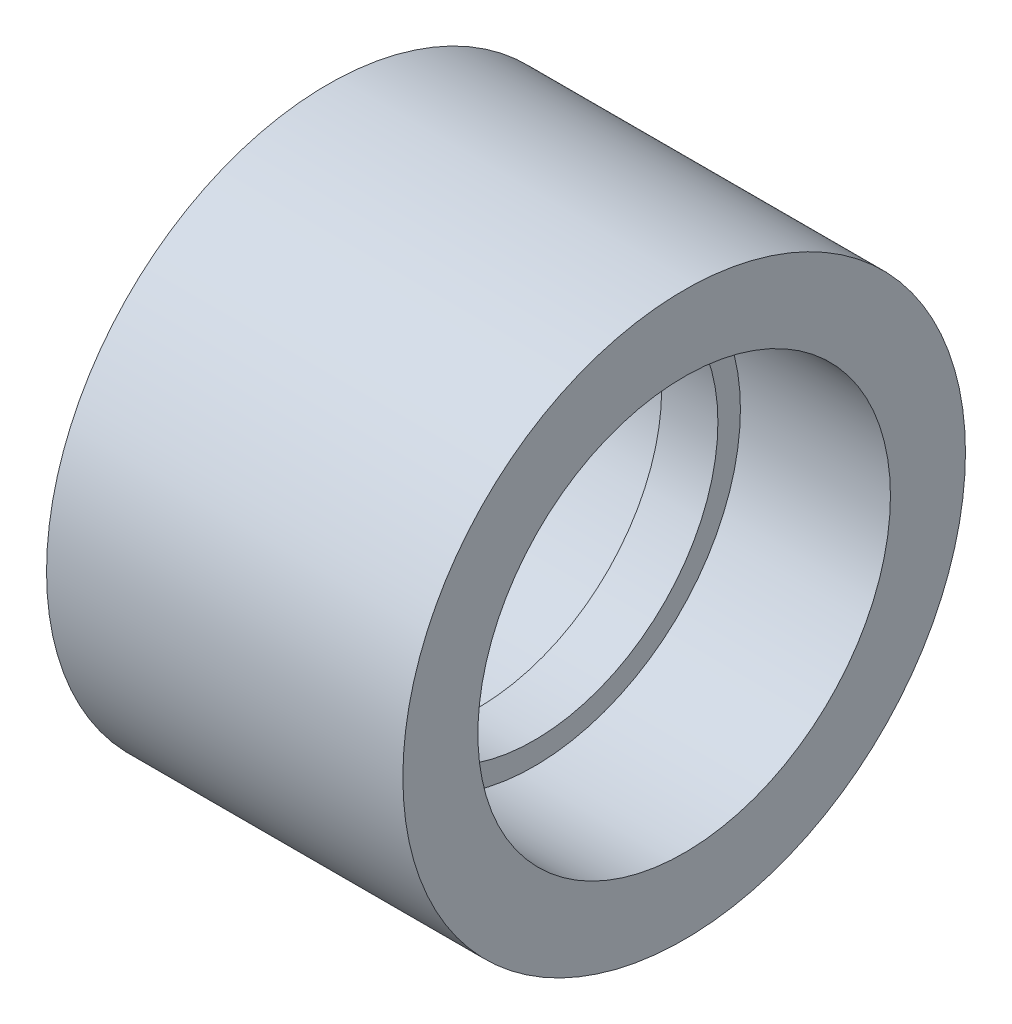
ISO-10303-21;
HEADER;
FILE_DESCRIPTION(('STEP AP214'),'2;1');
FILE_NAME('part.step','',(''),(''),'','','');
FILE_SCHEMA(('AUTOMOTIVE_DESIGN { 1 0 10303 214 1 1 1 1 }'));
ENDSEC;
DATA;
#1=APPLICATION_CONTEXT('core data for automotive mechanical design processes');
#2=APPLICATION_PROTOCOL_DEFINITION('international standard','automotive_design',2000,#1);
#3=PRODUCT_CONTEXT('',#1,'mechanical');
#4=PRODUCT('Part','Part','',(#3));
#5=PRODUCT_RELATED_PRODUCT_CATEGORY('part','',(#4));
#6=PRODUCT_DEFINITION_FORMATION('','',#4);
#7=PRODUCT_DEFINITION_CONTEXT('part definition',#1,'design');
#8=PRODUCT_DEFINITION('design','',#6,#7);
#9=PRODUCT_DEFINITION_SHAPE('','',#8);
#10=(LENGTH_UNIT() NAMED_UNIT(*) SI_UNIT(.MILLI.,.METRE.));
#11=(NAMED_UNIT(*) PLANE_ANGLE_UNIT() SI_UNIT($,.RADIAN.));
#12=(NAMED_UNIT(*) SI_UNIT($,.STERADIAN.) SOLID_ANGLE_UNIT());
#13=UNCERTAINTY_MEASURE_WITH_UNIT(LENGTH_MEASURE(1.E-05),#10,'distance_accuracy_value','');
#14=(GEOMETRIC_REPRESENTATION_CONTEXT(3) GLOBAL_UNCERTAINTY_ASSIGNED_CONTEXT((#13)) GLOBAL_UNIT_ASSIGNED_CONTEXT((#10,
#11,#12)) REPRESENTATION_CONTEXT('',''));
#15=CARTESIAN_POINT('',(0.,0.,0.));
#16=DIRECTION('',(0.,0.,1.));
#17=DIRECTION('',(1.,0.,0.));
#18=AXIS2_PLACEMENT_3D('',#15,#16,#17);
#19=CARTESIAN_POINT('',(-9.5,0.,-15.));
#20=DIRECTION('',(-1.,0.,0.));
#21=DIRECTION('',(0.,0.,1.));
#22=AXIS2_PLACEMENT_3D('',#19,#20,#21);
#23=PLANE('',#22);
#24=CARTESIAN_POINT('',(-9.49999999999999,0.,0.));
#25=DIRECTION('',(1.,0.,0.));
#26=DIRECTION('',(0.,0.,-1.));
#27=AXIS2_PLACEMENT_3D('',#24,#25,#26);
#28=CIRCLE('',#27,11.);
#29=CARTESIAN_POINT('',(-9.49999999999999,0.,-11.));
#30=VERTEX_POINT('',#29);
#31=EDGE_CURVE('E10',#30,#30,#28,.T.);
#32=ORIENTED_EDGE('',*,*,#31,.T.);
#33=EDGE_LOOP('',(#32));
#34=FACE_BOUND('',#33,.T.);
#35=CARTESIAN_POINT('',(-9.49999999999999,0.,0.));
#36=DIRECTION('',(1.,0.,0.));
#37=DIRECTION('',(0.,0.,-1.));
#38=AXIS2_PLACEMENT_3D('',#35,#36,#37);
#39=CIRCLE('',#38,15.);
#40=CARTESIAN_POINT('',(-9.49999999999999,0.,-15.));
#41=VERTEX_POINT('',#40);
#42=EDGE_CURVE('E59',#41,#41,#39,.T.);
#43=ORIENTED_EDGE('',*,*,#42,.F.);
#44=EDGE_LOOP('',(#43));
#45=FACE_BOUND('',#44,.T.);
#46=ADVANCED_FACE('F31',(#34,#45),#23,.T.);
#47=CARTESIAN_POINT('',(88.99,0.,0.));
#48=DIRECTION('',(1.,0.,0.));
#49=DIRECTION('',(0.,0.,-1.));
#50=AXIS2_PLACEMENT_3D('',#47,#48,#49);
#51=CYLINDRICAL_SURFACE('',#50,11.);
#52=CARTESIAN_POINT('',(-1.5,0.,0.));
#53=DIRECTION('',(1.,0.,0.));
#54=DIRECTION('',(0.,0.,-1.));
#55=AXIS2_PLACEMENT_3D('',#52,#53,#54);
#56=CIRCLE('',#55,11.);
#57=CARTESIAN_POINT('',(-1.5,0.,-11.));
#58=VERTEX_POINT('',#57);
#59=EDGE_CURVE('E37',#58,#58,#56,.T.);
#60=ORIENTED_EDGE('',*,*,#59,.T.);
#61=EDGE_LOOP('',(#60));
#62=FACE_BOUND('',#61,.T.);
#63=ORIENTED_EDGE('',*,*,#31,.F.);
#64=EDGE_LOOP('',(#63));
#65=FACE_BOUND('',#64,.T.);
#66=ADVANCED_FACE('F67',(#62,#65),#51,.F.);
#67=CARTESIAN_POINT('',(-1.5,0.,-11.));
#68=DIRECTION('',(-1.,0.,0.));
#69=DIRECTION('',(0.,0.,1.));
#70=AXIS2_PLACEMENT_3D('',#67,#68,#69);
#71=PLANE('',#70);
#72=CARTESIAN_POINT('',(-1.5,0.,0.));
#73=DIRECTION('',(1.,0.,0.));
#74=DIRECTION('',(0.,0.,-1.));
#75=AXIS2_PLACEMENT_3D('',#72,#73,#74);
#76=CIRCLE('',#75,9.8);
#77=CARTESIAN_POINT('',(-1.5,0.,-9.8));
#78=VERTEX_POINT('',#77);
#79=EDGE_CURVE('E41',#78,#78,#76,.T.);
#80=ORIENTED_EDGE('',*,*,#79,.T.);
#81=EDGE_LOOP('',(#80));
#82=FACE_BOUND('',#81,.T.);
#83=ORIENTED_EDGE('',*,*,#59,.F.);
#84=EDGE_LOOP('',(#83));
#85=FACE_BOUND('',#84,.T.);
#86=ADVANCED_FACE('F71',(#82,#85),#71,.T.);
#87=CARTESIAN_POINT('',(88.99,0.,0.));
#88=DIRECTION('',(1.,0.,0.));
#89=DIRECTION('',(0.,0.,-1.));
#90=AXIS2_PLACEMENT_3D('',#87,#88,#89);
#91=CYLINDRICAL_SURFACE('',#90,9.8);
#92=CARTESIAN_POINT('',(1.5,0.,0.));
#93=DIRECTION('',(1.,0.,0.));
#94=DIRECTION('',(0.,0.,-1.));
#95=AXIS2_PLACEMENT_3D('',#92,#93,#94);
#96=CIRCLE('',#95,9.8);
#97=CARTESIAN_POINT('',(1.5,0.,-9.8));
#98=VERTEX_POINT('',#97);
#99=EDGE_CURVE('E45',#98,#98,#96,.T.);
#100=ORIENTED_EDGE('',*,*,#99,.T.);
#101=EDGE_LOOP('',(#100));
#102=FACE_BOUND('',#101,.T.);
#103=ORIENTED_EDGE('',*,*,#79,.F.);
#104=EDGE_LOOP('',(#103));
#105=FACE_BOUND('',#104,.T.);
#106=ADVANCED_FACE('F75',(#102,#105),#91,.F.);
#107=CARTESIAN_POINT('',(1.5,0.,-11.));
#108=DIRECTION('',(1.,0.,0.));
#109=DIRECTION('',(0.,0.,-1.));
#110=AXIS2_PLACEMENT_3D('',#107,#108,#109);
#111=PLANE('',#110);
#112=CARTESIAN_POINT('',(1.5,0.,0.));
#113=DIRECTION('',(1.,0.,0.));
#114=DIRECTION('',(0.,0.,-1.));
#115=AXIS2_PLACEMENT_3D('',#112,#113,#114);
#116=CIRCLE('',#115,11.);
#117=CARTESIAN_POINT('',(1.5,0.,-11.));
#118=VERTEX_POINT('',#117);
#119=EDGE_CURVE('E50',#118,#118,#116,.T.);
#120=ORIENTED_EDGE('',*,*,#119,.T.);
#121=EDGE_LOOP('',(#120));
#122=FACE_BOUND('',#121,.T.);
#123=ORIENTED_EDGE('',*,*,#99,.F.);
#124=EDGE_LOOP('',(#123));
#125=FACE_BOUND('',#124,.T.);
#126=ADVANCED_FACE('F82',(#122,#125),#111,.T.);
#127=CARTESIAN_POINT('',(88.99,0.,0.));
#128=DIRECTION('',(1.,0.,0.));
#129=DIRECTION('',(0.,0.,-1.));
#130=AXIS2_PLACEMENT_3D('',#127,#128,#129);
#131=CYLINDRICAL_SURFACE('',#130,11.);
#132=CARTESIAN_POINT('',(9.49999999999999,0.,0.));
#133=DIRECTION('',(1.,0.,0.));
#134=DIRECTION('',(0.,0.,-1.));
#135=AXIS2_PLACEMENT_3D('',#132,#133,#134);
#136=CIRCLE('',#135,11.);
#137=CARTESIAN_POINT('',(9.49999999999999,0.,-11.));
#138=VERTEX_POINT('',#137);
#139=EDGE_CURVE('E53',#138,#138,#136,.T.);
#140=ORIENTED_EDGE('',*,*,#139,.T.);
#141=EDGE_LOOP('',(#140));
#142=FACE_BOUND('',#141,.T.);
#143=ORIENTED_EDGE('',*,*,#119,.F.);
#144=EDGE_LOOP('',(#143));
#145=FACE_BOUND('',#144,.T.);
#146=ADVANCED_FACE('F86',(#142,#145),#131,.F.);
#147=CARTESIAN_POINT('',(9.5,0.,-15.));
#148=DIRECTION('',(1.,0.,0.));
#149=DIRECTION('',(0.,0.,-1.));
#150=AXIS2_PLACEMENT_3D('',#147,#148,#149);
#151=PLANE('',#150);
#152=CARTESIAN_POINT('',(9.49999999999999,0.,0.));
#153=DIRECTION('',(1.,0.,0.));
#154=DIRECTION('',(0.,0.,-1.));
#155=AXIS2_PLACEMENT_3D('',#152,#153,#154);
#156=CIRCLE('',#155,15.);
#157=CARTESIAN_POINT('',(9.49999999999999,0.,-15.));
#158=VERTEX_POINT('',#157);
#159=EDGE_CURVE('E56',#158,#158,#156,.T.);
#160=ORIENTED_EDGE('',*,*,#159,.T.);
#161=EDGE_LOOP('',(#160));
#162=FACE_BOUND('',#161,.T.);
#163=ORIENTED_EDGE('',*,*,#139,.F.);
#164=EDGE_LOOP('',(#163));
#165=FACE_BOUND('',#164,.T.);
#166=ADVANCED_FACE('F90',(#162,#165),#151,.T.);
#167=CARTESIAN_POINT('',(88.99,0.,0.));
#168=DIRECTION('',(1.,0.,0.));
#169=DIRECTION('',(0.,0.,-1.));
#170=AXIS2_PLACEMENT_3D('',#167,#168,#169);
#171=CYLINDRICAL_SURFACE('',#170,15.);
#172=ORIENTED_EDGE('',*,*,#42,.T.);
#173=EDGE_LOOP('',(#172));
#174=FACE_BOUND('',#173,.T.);
#175=ORIENTED_EDGE('',*,*,#159,.F.);
#176=EDGE_LOOP('',(#175));
#177=FACE_BOUND('',#176,.T.);
#178=ADVANCED_FACE('F63',(#174,#177),#171,.T.);
#179=CLOSED_SHELL('',(#46,#66,#86,#106,#126,#146,#166,#178));
#180=MANIFOLD_SOLID_BREP('B2',#179);
#181=ADVANCED_BREP_SHAPE_REPRESENTATION('',(#18,#180),#14);
#182=SHAPE_DEFINITION_REPRESENTATION(#9,#181);
ENDSEC;
END-ISO-10303-21;
